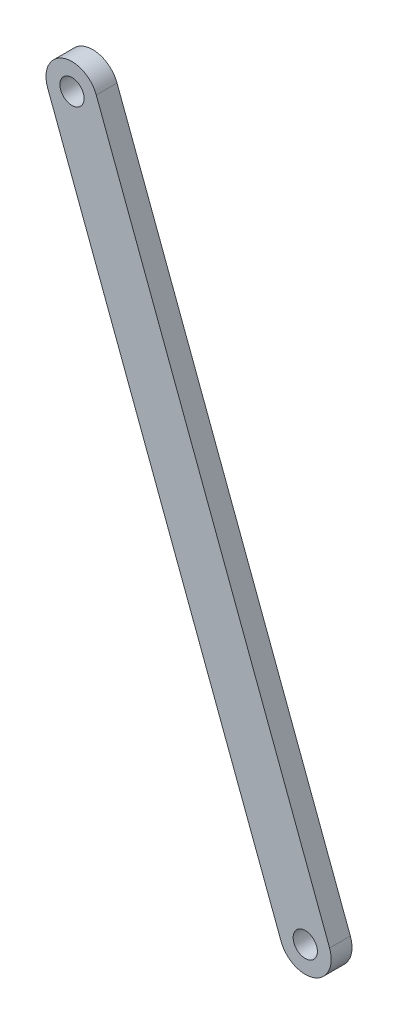
ISO-10303-21;
HEADER;
FILE_DESCRIPTION(('STEP AP214'),'2;1');
FILE_NAME('part.step','',(''),(''),'','','');
FILE_SCHEMA(('AUTOMOTIVE_DESIGN { 1 0 10303 214 1 1 1 1 }'));
ENDSEC;
DATA;
#1=APPLICATION_CONTEXT('core data for automotive mechanical design processes');
#2=APPLICATION_PROTOCOL_DEFINITION('international standard','automotive_design',2000,#1);
#3=PRODUCT_CONTEXT('',#1,'mechanical');
#4=PRODUCT('Part','Part','',(#3));
#5=PRODUCT_RELATED_PRODUCT_CATEGORY('part','',(#4));
#6=PRODUCT_DEFINITION_FORMATION('','',#4);
#7=PRODUCT_DEFINITION_CONTEXT('part definition',#1,'design');
#8=PRODUCT_DEFINITION('design','',#6,#7);
#9=PRODUCT_DEFINITION_SHAPE('','',#8);
#10=(LENGTH_UNIT() NAMED_UNIT(*) SI_UNIT(.MILLI.,.METRE.));
#11=(NAMED_UNIT(*) PLANE_ANGLE_UNIT() SI_UNIT($,.RADIAN.));
#12=(NAMED_UNIT(*) SI_UNIT($,.STERADIAN.) SOLID_ANGLE_UNIT());
#13=UNCERTAINTY_MEASURE_WITH_UNIT(LENGTH_MEASURE(1.E-05),#10,'distance_accuracy_value','');
#14=(GEOMETRIC_REPRESENTATION_CONTEXT(3) GLOBAL_UNCERTAINTY_ASSIGNED_CONTEXT((#13)) GLOBAL_UNIT_ASSIGNED_CONTEXT((#10,
#11,#12)) REPRESENTATION_CONTEXT('',''));
#15=CARTESIAN_POINT('',(0.,0.,0.));
#16=DIRECTION('',(0.,0.,1.));
#17=DIRECTION('',(1.,0.,0.));
#18=AXIS2_PLACEMENT_3D('',#15,#16,#17);
#19=CARTESIAN_POINT('',(-67.4254862550688,-79.1820926931559,6.));
#20=DIRECTION('',(0.,0.,1.));
#21=DIRECTION('',(1.,0.,0.));
#22=AXIS2_PLACEMENT_3D('',#19,#20,#21);
#23=PLANE('',#22);
#24=CARTESIAN_POINT('',(-67.4254862550688,-79.1820926931559,6.));
#25=DIRECTION('',(0.,0.,1.));
#26=DIRECTION('',(1.,0.,0.));
#27=AXIS2_PLACEMENT_3D('',#24,#25,#26);
#28=CIRCLE('',#27,3.50000000000001);
#29=CARTESIAN_POINT('',(-63.9254862550688,-79.1820926931559,6.));
#30=VERTEX_POINT('',#29);
#31=EDGE_CURVE('E100',#30,#30,#28,.T.);
#32=ORIENTED_EDGE('',*,*,#31,.F.);
#33=EDGE_LOOP('',(#32));
#34=FACE_BOUND('',#33,.T.);
#35=CARTESIAN_POINT('',(-67.4254862550688,-79.1820926931559,6.));
#36=DIRECTION('',(0.,0.,1.));
#37=DIRECTION('',(1.,0.,0.));
#38=AXIS2_PLACEMENT_3D('',#35,#36,#37);
#39=CIRCLE('',#38,7.49999999999999);
#40=CARTESIAN_POINT('',(-60.4031607770144,-76.5482846363172,6.));
#41=VERTEX_POINT('',#40);
#42=CARTESIAN_POINT('',(-74.4478117331232,-81.8159007499945,6.));
#43=VERTEX_POINT('',#42);
#44=EDGE_CURVE('E85',#41,#43,#39,.T.);
#45=ORIENTED_EDGE('',*,*,#44,.T.);
#46=DIRECTION('',(0.351174407578484,-0.936310063740586,0.));
#47=VECTOR('',#46,1.);
#48=CARTESIAN_POINT('',(-74.4478117331232,-81.8159007499945,6.));
#49=LINE('',#48,#47);
#50=CARTESIAN_POINT('',(-7.02232547805436,-261.587432988187,6.));
#51=VERTEX_POINT('',#50);
#52=EDGE_CURVE('E80',#43,#51,#49,.T.);
#53=ORIENTED_EDGE('',*,*,#52,.T.);
#54=CARTESIAN_POINT('',(0.,-258.953624931348,6.));
#55=DIRECTION('',(0.,0.,1.));
#56=DIRECTION('',(1.,0.,0.));
#57=AXIS2_PLACEMENT_3D('',#54,#55,#56);
#58=CIRCLE('',#57,7.49999999999997);
#59=CARTESIAN_POINT('',(7.02232547805441,-256.31981687451,6.));
#60=VERTEX_POINT('',#59);
#61=EDGE_CURVE('E83',#51,#60,#58,.T.);
#62=ORIENTED_EDGE('',*,*,#61,.T.);
#63=DIRECTION('',(-0.351174407578483,0.936310063740586,0.));
#64=VECTOR('',#63,1.);
#65=CARTESIAN_POINT('',(-60.4031607770144,-76.5482846363172,6.));
#66=LINE('',#65,#64);
#67=EDGE_CURVE('E50',#60,#41,#66,.T.);
#68=ORIENTED_EDGE('',*,*,#67,.T.);
#69=EDGE_LOOP('',(#45,#53,#62,#68));
#70=FACE_BOUND('',#69,.T.);
#71=CARTESIAN_POINT('',(0.,-258.953624931348,6.));
#72=DIRECTION('',(0.,0.,1.));
#73=DIRECTION('',(1.,0.,0.));
#74=AXIS2_PLACEMENT_3D('',#71,#72,#73);
#75=CIRCLE('',#74,3.50000000000001);
#76=CARTESIAN_POINT('',(3.50000000000002,-258.953624931348,6.));
#77=VERTEX_POINT('',#76);
#78=EDGE_CURVE('E115',#77,#77,#75,.T.);
#79=ORIENTED_EDGE('',*,*,#78,.F.);
#80=EDGE_LOOP('',(#79));
#81=FACE_BOUND('',#80,.T.);
#82=ADVANCED_FACE('F33',(#34,#70,#81),#23,.T.);
#83=CARTESIAN_POINT('',(-67.4254862550688,-79.1820926931559,0.));
#84=DIRECTION('',(0.,0.,1.));
#85=DIRECTION('',(1.,0.,0.));
#86=AXIS2_PLACEMENT_3D('',#83,#84,#85);
#87=PLANE('',#86);
#88=CARTESIAN_POINT('',(-67.4254862550688,-79.1820926931559,0.));
#89=DIRECTION('',(0.,0.,1.));
#90=DIRECTION('',(1.,0.,0.));
#91=AXIS2_PLACEMENT_3D('',#88,#89,#90);
#92=CIRCLE('',#91,7.49999999999999);
#93=CARTESIAN_POINT('',(-60.4031607770144,-76.5482846363172,0.));
#94=VERTEX_POINT('',#93);
#95=CARTESIAN_POINT('',(-74.4478117331232,-81.8159007499945,0.));
#96=VERTEX_POINT('',#95);
#97=EDGE_CURVE('E97',#94,#96,#92,.T.);
#98=ORIENTED_EDGE('',*,*,#97,.F.);
#99=DIRECTION('',(-0.351174407578483,0.936310063740586,0.));
#100=VECTOR('',#99,1.);
#101=CARTESIAN_POINT('',(-60.4031607770144,-76.5482846363172,0.));
#102=LINE('',#101,#100);
#103=CARTESIAN_POINT('',(7.02232547805441,-256.31981687451,0.));
#104=VERTEX_POINT('',#103);
#105=EDGE_CURVE('E73',#104,#94,#102,.T.);
#106=ORIENTED_EDGE('',*,*,#105,.F.);
#107=CARTESIAN_POINT('',(0.,-258.953624931348,0.));
#108=DIRECTION('',(0.,0.,1.));
#109=DIRECTION('',(1.,0.,0.));
#110=AXIS2_PLACEMENT_3D('',#107,#108,#109);
#111=CIRCLE('',#110,7.49999999999997);
#112=CARTESIAN_POINT('',(-7.02232547805436,-261.587432988187,0.));
#113=VERTEX_POINT('',#112);
#114=EDGE_CURVE('E67',#113,#104,#111,.T.);
#115=ORIENTED_EDGE('',*,*,#114,.F.);
#116=DIRECTION('',(0.351174407578484,-0.936310063740586,0.));
#117=VECTOR('',#116,1.);
#118=CARTESIAN_POINT('',(-74.4478117331232,-81.8159007499945,0.));
#119=LINE('',#118,#117);
#120=EDGE_CURVE('E89',#96,#113,#119,.T.);
#121=ORIENTED_EDGE('',*,*,#120,.F.);
#122=EDGE_LOOP('',(#98,#106,#115,#121));
#123=FACE_BOUND('',#122,.T.);
#124=CARTESIAN_POINT('',(-67.4254862550688,-79.1820926931559,0.));
#125=DIRECTION('',(0.,0.,1.));
#126=DIRECTION('',(1.,0.,0.));
#127=AXIS2_PLACEMENT_3D('',#124,#125,#126);
#128=CIRCLE('',#127,3.50000000000001);
#129=CARTESIAN_POINT('',(-63.9254862550688,-79.1820926931559,0.));
#130=VERTEX_POINT('',#129);
#131=EDGE_CURVE('E112',#130,#130,#128,.T.);
#132=ORIENTED_EDGE('',*,*,#131,.T.);
#133=EDGE_LOOP('',(#132));
#134=FACE_BOUND('',#133,.T.);
#135=CARTESIAN_POINT('',(0.,-258.953624931348,0.));
#136=DIRECTION('',(0.,0.,1.));
#137=DIRECTION('',(1.,0.,0.));
#138=AXIS2_PLACEMENT_3D('',#135,#136,#137);
#139=CIRCLE('',#138,3.50000000000001);
#140=CARTESIAN_POINT('',(3.50000000000002,-258.953624931348,0.));
#141=VERTEX_POINT('',#140);
#142=EDGE_CURVE('E118',#141,#141,#139,.T.);
#143=ORIENTED_EDGE('',*,*,#142,.T.);
#144=EDGE_LOOP('',(#143));
#145=FACE_BOUND('',#144,.T.);
#146=ADVANCED_FACE('F108',(#123,#134,#145),#87,.F.);
#147=CARTESIAN_POINT('',(-67.4254862550688,-79.1820926931559,6.));
#148=DIRECTION('',(0.,0.,-1.));
#149=DIRECTION('',(-1.,0.,0.));
#150=AXIS2_PLACEMENT_3D('',#147,#148,#149);
#151=CYLINDRICAL_SURFACE('',#150,7.49999999999999);
#152=ORIENTED_EDGE('',*,*,#97,.T.);
#153=DIRECTION('',(0.,0.,-1.));
#154=VECTOR('',#153,1.);
#155=CARTESIAN_POINT('',(-74.4478117331232,-81.8159007499945,6.));
#156=LINE('',#155,#154);
#157=EDGE_CURVE('E11',#43,#96,#156,.T.);
#158=ORIENTED_EDGE('',*,*,#157,.F.);
#159=ORIENTED_EDGE('',*,*,#44,.F.);
#160=DIRECTION('',(0.,0.,-1.));
#161=VECTOR('',#160,1.);
#162=CARTESIAN_POINT('',(-60.4031607770144,-76.5482846363172,6.));
#163=LINE('',#162,#161);
#164=EDGE_CURVE('E93',#41,#94,#163,.T.);
#165=ORIENTED_EDGE('',*,*,#164,.T.);
#166=EDGE_LOOP('',(#152,#158,#159,#165));
#167=FACE_BOUND('',#166,.T.);
#168=ADVANCED_FACE('F35',(#167),#151,.T.);
#169=CARTESIAN_POINT('',(-74.4478117331232,-81.8159007499945,6.));
#170=DIRECTION('',(0.936310063740586,0.351174407578484,0.));
#171=DIRECTION('',(-0.351174407578484,0.936310063740587,0.));
#172=AXIS2_PLACEMENT_3D('',#169,#170,#171);
#173=PLANE('',#172);
#174=ORIENTED_EDGE('',*,*,#120,.T.);
#175=DIRECTION('',(0.,0.,-1.));
#176=VECTOR('',#175,1.);
#177=CARTESIAN_POINT('',(-7.02232547805436,-261.587432988187,6.));
#178=LINE('',#177,#176);
#179=EDGE_CURVE('E42',#51,#113,#178,.T.);
#180=ORIENTED_EDGE('',*,*,#179,.F.);
#181=ORIENTED_EDGE('',*,*,#52,.F.);
#182=ORIENTED_EDGE('',*,*,#157,.T.);
#183=EDGE_LOOP('',(#174,#180,#181,#182));
#184=FACE_BOUND('',#183,.T.);
#185=ADVANCED_FACE('F88',(#184),#173,.F.);
#186=CARTESIAN_POINT('',(0.,-258.953624931348,6.));
#187=DIRECTION('',(0.,0.,-1.));
#188=DIRECTION('',(-1.,0.,0.));
#189=AXIS2_PLACEMENT_3D('',#186,#187,#188);
#190=CYLINDRICAL_SURFACE('',#189,7.49999999999997);
#191=ORIENTED_EDGE('',*,*,#114,.T.);
#192=DIRECTION('',(0.,0.,-1.));
#193=VECTOR('',#192,1.);
#194=CARTESIAN_POINT('',(7.02232547805441,-256.31981687451,6.));
#195=LINE('',#194,#193);
#196=EDGE_CURVE('E90',#60,#104,#195,.T.);
#197=ORIENTED_EDGE('',*,*,#196,.F.);
#198=ORIENTED_EDGE('',*,*,#61,.F.);
#199=ORIENTED_EDGE('',*,*,#179,.T.);
#200=EDGE_LOOP('',(#191,#197,#198,#199));
#201=FACE_BOUND('',#200,.T.);
#202=ADVANCED_FACE('F91',(#201),#190,.T.);
#203=CARTESIAN_POINT('',(-60.4031607770144,-76.5482846363172,6.));
#204=DIRECTION('',(-0.936310063740586,-0.351174407578483,0.));
#205=DIRECTION('',(0.351174407578483,-0.936310063740587,0.));
#206=AXIS2_PLACEMENT_3D('',#203,#204,#205);
#207=PLANE('',#206);
#208=ORIENTED_EDGE('',*,*,#105,.T.);
#209=ORIENTED_EDGE('',*,*,#164,.F.);
#210=ORIENTED_EDGE('',*,*,#67,.F.);
#211=ORIENTED_EDGE('',*,*,#196,.T.);
#212=EDGE_LOOP('',(#208,#209,#210,#211));
#213=FACE_BOUND('',#212,.T.);
#214=ADVANCED_FACE('F105',(#213),#207,.F.);
#215=CARTESIAN_POINT('',(-67.4254862550688,-79.1820926931559,6.));
#216=DIRECTION('',(0.,0.,-1.));
#217=DIRECTION('',(-1.,0.,0.));
#218=AXIS2_PLACEMENT_3D('',#215,#216,#217);
#219=CYLINDRICAL_SURFACE('',#218,3.50000000000001);
#220=ORIENTED_EDGE('',*,*,#31,.T.);
#221=EDGE_LOOP('',(#220));
#222=FACE_BOUND('',#221,.T.);
#223=ORIENTED_EDGE('',*,*,#131,.F.);
#224=EDGE_LOOP('',(#223));
#225=FACE_BOUND('',#224,.T.);
#226=ADVANCED_FACE('F135',(#222,#225),#219,.F.);
#227=CARTESIAN_POINT('',(0.,-258.953624931348,6.));
#228=DIRECTION('',(0.,0.,-1.));
#229=DIRECTION('',(-1.,0.,0.));
#230=AXIS2_PLACEMENT_3D('',#227,#228,#229);
#231=CYLINDRICAL_SURFACE('',#230,3.50000000000001);
#232=ORIENTED_EDGE('',*,*,#78,.T.);
#233=EDGE_LOOP('',(#232));
#234=FACE_BOUND('',#233,.T.);
#235=ORIENTED_EDGE('',*,*,#142,.F.);
#236=EDGE_LOOP('',(#235));
#237=FACE_BOUND('',#236,.T.);
#238=ADVANCED_FACE('F124',(#234,#237),#231,.F.);
#239=CLOSED_SHELL('',(#82,#146,#168,#185,#202,#214,#226,#238));
#240=MANIFOLD_SOLID_BREP('B2',#239);
#241=ADVANCED_BREP_SHAPE_REPRESENTATION('',(#18,#240),#14);
#242=SHAPE_DEFINITION_REPRESENTATION(#9,#241);
ENDSEC;
END-ISO-10303-21;
